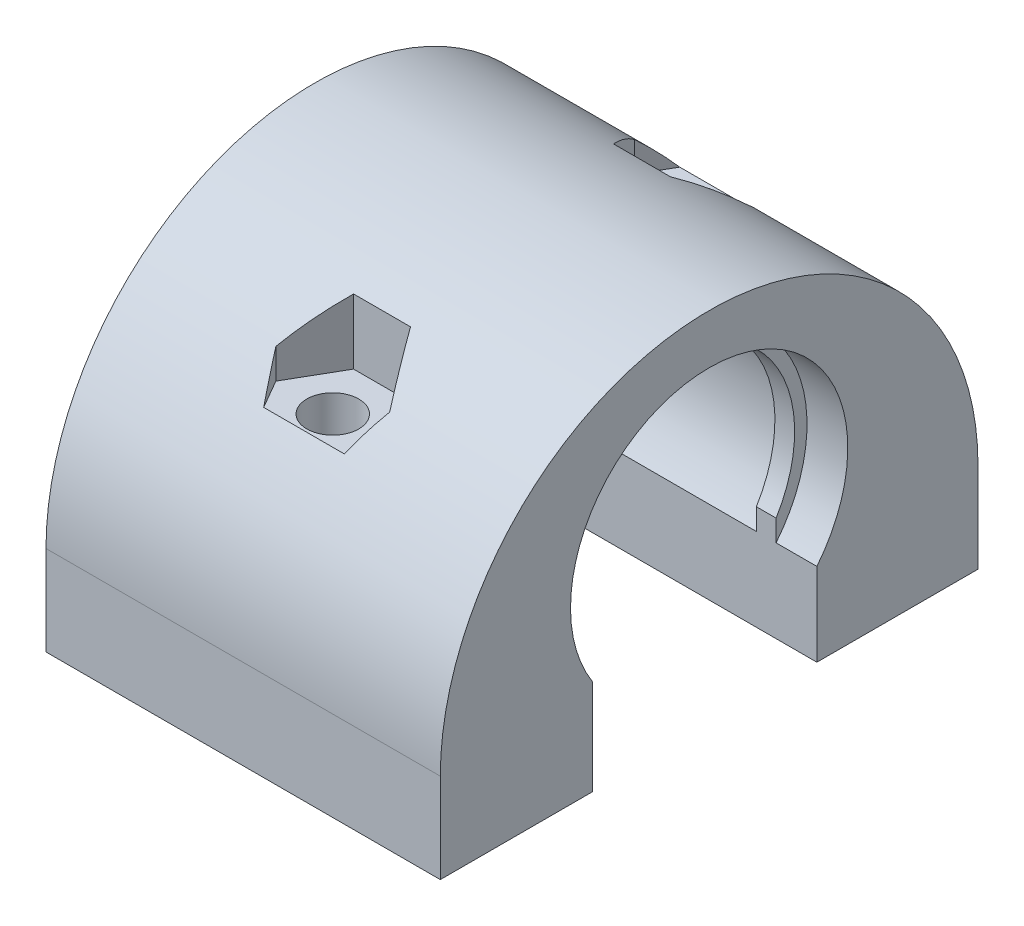
ISO-10303-21;
HEADER;
FILE_DESCRIPTION(('STEP AP214'),'2;1');
FILE_NAME('part.step','',(''),(''),'','','');
FILE_SCHEMA(('AUTOMOTIVE_DESIGN { 1 0 10303 214 1 1 1 1 }'));
ENDSEC;
DATA;
#1=APPLICATION_CONTEXT('core data for automotive mechanical design processes');
#2=APPLICATION_PROTOCOL_DEFINITION('international standard','automotive_design',2000,#1);
#3=PRODUCT_CONTEXT('',#1,'mechanical');
#4=PRODUCT('Part','Part','',(#3));
#5=PRODUCT_RELATED_PRODUCT_CATEGORY('part','',(#4));
#6=PRODUCT_DEFINITION_FORMATION('','',#4);
#7=PRODUCT_DEFINITION_CONTEXT('part definition',#1,'design');
#8=PRODUCT_DEFINITION('design','',#6,#7);
#9=PRODUCT_DEFINITION_SHAPE('','',#8);
#10=(LENGTH_UNIT() NAMED_UNIT(*) SI_UNIT(.MILLI.,.METRE.));
#11=(NAMED_UNIT(*) PLANE_ANGLE_UNIT() SI_UNIT($,.RADIAN.));
#12=(NAMED_UNIT(*) SI_UNIT($,.STERADIAN.) SOLID_ANGLE_UNIT());
#13=UNCERTAINTY_MEASURE_WITH_UNIT(LENGTH_MEASURE(1.E-05),#10,'distance_accuracy_value','');
#14=(GEOMETRIC_REPRESENTATION_CONTEXT(3) GLOBAL_UNCERTAINTY_ASSIGNED_CONTEXT((#13)) GLOBAL_UNIT_ASSIGNED_CONTEXT((#10,
#11,#12)) REPRESENTATION_CONTEXT('',''));
#15=CARTESIAN_POINT('',(0.,0.,0.));
#16=DIRECTION('',(0.,0.,1.));
#17=DIRECTION('',(1.,0.,0.));
#18=AXIS2_PLACEMENT_3D('',#15,#16,#17);
#19=CARTESIAN_POINT('',(3.00000000000002,9.5,0.));
#20=DIRECTION('',(-1.,0.,0.));
#21=DIRECTION('',(0.,0.,1.));
#22=AXIS2_PLACEMENT_3D('',#19,#20,#21);
#23=CYLINDRICAL_SURFACE('',#22,7.735);
#24=CARTESIAN_POINT('',(0.,9.5,0.));
#25=DIRECTION('',(-1.,0.,0.));
#26=DIRECTION('',(0.,0.,1.));
#27=AXIS2_PLACEMENT_3D('',#24,#25,#26);
#28=CIRCLE('',#27,7.735);
#29=CARTESIAN_POINT('',(0.,5.33016037673729,6.51480333673));
#30=VERTEX_POINT('',#29);
#31=CARTESIAN_POINT('',(0.,4.63069563489814,-6.01));
#32=VERTEX_POINT('',#31);
#33=EDGE_CURVE('E270',#30,#32,#28,.T.);
#34=ORIENTED_EDGE('',*,*,#33,.F.);
#35=DIRECTION('',(-1.,0.,0.));
#36=VECTOR('',#35,1.);
#37=CARTESIAN_POINT('',(3.00000000000002,5.33016037673729,6.51480333673));
#38=LINE('',#37,#36);
#39=CARTESIAN_POINT('',(-22.,5.33016037673729,6.51480333673));
#40=VERTEX_POINT('',#39);
#41=EDGE_CURVE('E51',#30,#40,#38,.T.);
#42=ORIENTED_EDGE('',*,*,#41,.T.);
#43=CARTESIAN_POINT('',(-22.,9.5,0.));
#44=DIRECTION('',(-1.,0.,0.));
#45=DIRECTION('',(0.,0.,1.));
#46=AXIS2_PLACEMENT_3D('',#43,#44,#45);
#47=CIRCLE('',#46,7.735);
#48=CARTESIAN_POINT('',(-22.,4.63069563489814,-6.01));
#49=VERTEX_POINT('',#48);
#50=EDGE_CURVE('E272',#40,#49,#47,.T.);
#51=ORIENTED_EDGE('',*,*,#50,.T.);
#52=DIRECTION('',(-1.,0.,0.));
#53=VECTOR('',#52,1.);
#54=CARTESIAN_POINT('',(3.00000000000002,4.63069563489814,-6.01));
#55=LINE('',#54,#53);
#56=CARTESIAN_POINT('',(-19.725,4.63069563489814,-6.01));
#57=VERTEX_POINT('',#56);
#58=EDGE_CURVE('E273',#49,#57,#55,.F.);
#59=ORIENTED_EDGE('',*,*,#58,.T.);
#60=CARTESIAN_POINT('',(-19.725,9.5,0.));
#61=DIRECTION('',(1.,0.,0.));
#62=DIRECTION('',(0.,0.,-1.));
#63=AXIS2_PLACEMENT_3D('',#60,#61,#62);
#64=CIRCLE('',#63,7.735);
#65=CARTESIAN_POINT('',(-19.725,17.2349983839688,-0.00500000000201291));
#66=VERTEX_POINT('',#65);
#67=EDGE_CURVE('E344',#66,#57,#64,.F.);
#68=ORIENTED_EDGE('',*,*,#67,.F.);
#69=DIRECTION('',(-1.,0.,0.));
#70=VECTOR('',#69,1.);
#71=CARTESIAN_POINT('',(-19.175,17.2349983839688,-0.00500000000201291));
#72=LINE('',#71,#70);
#73=CARTESIAN_POINT('',(-18.625,17.2349983839688,-0.00500000000201291));
#74=VERTEX_POINT('',#73);
#75=EDGE_CURVE('E336',#74,#66,#72,.T.);
#76=ORIENTED_EDGE('',*,*,#75,.F.);
#77=CARTESIAN_POINT('',(-18.625,9.5,0.));
#78=DIRECTION('',(-1.,0.,0.));
#79=DIRECTION('',(0.,0.,1.));
#80=AXIS2_PLACEMENT_3D('',#77,#78,#79);
#81=CIRCLE('',#80,7.735);
#82=CARTESIAN_POINT('',(-18.625,4.63069563489814,-6.01));
#83=VERTEX_POINT('',#82);
#84=EDGE_CURVE('E346',#83,#74,#81,.F.);
#85=ORIENTED_EDGE('',*,*,#84,.F.);
#86=CARTESIAN_POINT('',(-3.375,4.63069563489814,-6.01));
#87=VERTEX_POINT('',#86);
#88=EDGE_CURVE('E277',#83,#87,#55,.F.);
#89=ORIENTED_EDGE('',*,*,#88,.T.);
#90=CARTESIAN_POINT('',(-3.375,9.5,0.));
#91=DIRECTION('',(1.,0.,0.));
#92=DIRECTION('',(0.,0.,-1.));
#93=AXIS2_PLACEMENT_3D('',#90,#91,#92);
#94=CIRCLE('',#93,7.735);
#95=CARTESIAN_POINT('',(-3.375,17.2349983839688,-0.00500000000201291));
#96=VERTEX_POINT('',#95);
#97=EDGE_CURVE('E365',#96,#87,#94,.F.);
#98=ORIENTED_EDGE('',*,*,#97,.F.);
#99=DIRECTION('',(-1.,0.,0.));
#100=VECTOR('',#99,1.);
#101=CARTESIAN_POINT('',(-2.825,17.2349983839688,-0.00500000000201291));
#102=LINE('',#101,#100);
#103=CARTESIAN_POINT('',(-2.275,17.2349983839688,-0.00500000000201291));
#104=VERTEX_POINT('',#103);
#105=EDGE_CURVE('E359',#104,#96,#102,.T.);
#106=ORIENTED_EDGE('',*,*,#105,.F.);
#107=CARTESIAN_POINT('',(-2.275,9.5,0.));
#108=DIRECTION('',(-1.,0.,0.));
#109=DIRECTION('',(0.,0.,1.));
#110=AXIS2_PLACEMENT_3D('',#107,#108,#109);
#111=CIRCLE('',#110,7.735);
#112=CARTESIAN_POINT('',(-2.275,4.63069563489814,-6.01));
#113=VERTEX_POINT('',#112);
#114=EDGE_CURVE('E362',#113,#104,#111,.F.);
#115=ORIENTED_EDGE('',*,*,#114,.F.);
#116=EDGE_CURVE('E269',#113,#32,#55,.F.);
#117=ORIENTED_EDGE('',*,*,#116,.T.);
#118=EDGE_LOOP('',(#34,#42,#51,#59,#68,#76,#85,#89,#98,#106,#115,#117));
#119=FACE_BOUND('',#118,.T.);
#120=ADVANCED_FACE('F35',(#119),#23,.F.);
#121=CARTESIAN_POINT('',(-22.,4.99999999999999,-6.01));
#122=DIRECTION('',(0.,0.,-1.));
#123=DIRECTION('',(-1.,0.,0.));
#124=AXIS2_PLACEMENT_3D('',#121,#122,#123);
#125=PLANE('',#124);
#126=ORIENTED_EDGE('',*,*,#116,.F.);
#127=DIRECTION('',(0.,-1.,0.));
#128=VECTOR('',#127,1.);
#129=CARTESIAN_POINT('',(-2.275,17.235,-6.01));
#130=LINE('',#129,#128);
#131=CARTESIAN_POINT('',(-2.275,5.82695970618343,-6.01));
#132=VERTEX_POINT('',#131);
#133=EDGE_CURVE('E482',#132,#113,#130,.T.);
#134=ORIENTED_EDGE('',*,*,#133,.F.);
#135=DIRECTION('',(-1.,0.,0.));
#136=VECTOR('',#135,1.);
#137=CARTESIAN_POINT('',(-21.5348154568122,5.82695970618343,-6.01));
#138=LINE('',#137,#136);
#139=CARTESIAN_POINT('',(-3.375,5.82695970618343,-6.01));
#140=VERTEX_POINT('',#139);
#141=EDGE_CURVE('E485',#140,#132,#138,.F.);
#142=ORIENTED_EDGE('',*,*,#141,.F.);
#143=DIRECTION('',(0.,1.,0.));
#144=VECTOR('',#143,1.);
#145=CARTESIAN_POINT('',(-3.375,17.235,-6.01));
#146=LINE('',#145,#144);
#147=EDGE_CURVE('E472',#87,#140,#146,.T.);
#148=ORIENTED_EDGE('',*,*,#147,.F.);
#149=ORIENTED_EDGE('',*,*,#88,.F.);
#150=DIRECTION('',(0.,-1.,0.));
#151=VECTOR('',#150,1.);
#152=CARTESIAN_POINT('',(-18.625,17.235,-6.01));
#153=LINE('',#152,#151);
#154=CARTESIAN_POINT('',(-18.625,5.82695970618343,-6.01));
#155=VERTEX_POINT('',#154);
#156=EDGE_CURVE('E490',#155,#83,#153,.T.);
#157=ORIENTED_EDGE('',*,*,#156,.F.);
#158=DIRECTION('',(-1.,0.,0.));
#159=VECTOR('',#158,1.);
#160=CARTESIAN_POINT('',(-21.5348154568122,5.82695970618344,-6.01));
#161=LINE('',#160,#159);
#162=CARTESIAN_POINT('',(-19.725,5.82695970618344,-6.01));
#163=VERTEX_POINT('',#162);
#164=EDGE_CURVE('E11',#163,#155,#161,.F.);
#165=ORIENTED_EDGE('',*,*,#164,.F.);
#166=DIRECTION('',(0.,1.,0.));
#167=VECTOR('',#166,1.);
#168=CARTESIAN_POINT('',(-19.725,17.235,-6.01));
#169=LINE('',#168,#167);
#170=EDGE_CURVE('E333',#57,#163,#169,.T.);
#171=ORIENTED_EDGE('',*,*,#170,.F.);
#172=ORIENTED_EDGE('',*,*,#58,.F.);
#173=DIRECTION('',(0.,-1.,0.));
#174=VECTOR('',#173,1.);
#175=CARTESIAN_POINT('',(-22.,4.99999999999999,-6.01));
#176=LINE('',#175,#174);
#177=CARTESIAN_POINT('',(-22.,0.,-6.01));
#178=VERTEX_POINT('',#177);
#179=EDGE_CURVE('E420',#49,#178,#176,.T.);
#180=ORIENTED_EDGE('',*,*,#179,.T.);
#181=DIRECTION('',(1.,0.,0.));
#182=VECTOR('',#181,1.);
#183=CARTESIAN_POINT('',(-22.,0.,-6.01));
#184=LINE('',#183,#182);
#185=CARTESIAN_POINT('',(0.,0.,-6.01));
#186=VERTEX_POINT('',#185);
#187=EDGE_CURVE('E418',#178,#186,#184,.T.);
#188=ORIENTED_EDGE('',*,*,#187,.T.);
#189=DIRECTION('',(0.,-1.,0.));
#190=VECTOR('',#189,1.);
#191=CARTESIAN_POINT('',(0.,4.99999999999999,-6.01));
#192=LINE('',#191,#190);
#193=EDGE_CURVE('E421',#32,#186,#192,.T.);
#194=ORIENTED_EDGE('',*,*,#193,.F.);
#195=EDGE_LOOP('',(#126,#134,#142,#148,#149,#157,#165,#171,#172,#180,#188,#194));
#196=FACE_BOUND('',#195,.T.);
#197=ADVANCED_FACE('F457',(#196),#125,.F.);
#198=CARTESIAN_POINT('',(-22.,5.,0.));
#199=DIRECTION('',(-1.,0.,0.));
#200=DIRECTION('',(0.,0.,1.));
#201=AXIS2_PLACEMENT_3D('',#198,#199,#200);
#202=CYLINDRICAL_SURFACE('',#201,15.);
#203=CARTESIAN_POINT('',(-2.05149730810374,5.,0.));
#204=DIRECTION('',(-0.866025403784439,0.,0.5));
#205=DIRECTION('',(-0.5,0.,-0.866025403784439));
#206=AXIS2_PLACEMENT_3D('',#203,#204,#205);
#207=ELLIPSE('',#206,17.3205080756888,15.);
#208=CARTESIAN_POINT('',(-8.75348706239811,14.5,-11.6081867662439));
#209=VERTEX_POINT('',#208);
#210=CARTESIAN_POINT('',(-7.825,16.1803398874989,-10.));
#211=VERTEX_POINT('',#210);
#212=EDGE_CURVE('E276',#209,#211,#207,.F.);
#213=ORIENTED_EDGE('',*,*,#212,.T.);
#214=CARTESIAN_POINT('',(-13.5985026918963,5.,0.));
#215=DIRECTION('',(-0.866025403784439,0.,-0.5));
#216=DIRECTION('',(-0.5,0.,0.866025403784439));
#217=AXIS2_PLACEMENT_3D('',#214,#215,#216);
#218=ELLIPSE('',#217,17.3205080756888,15.);
#219=CARTESIAN_POINT('',(-9.4125,18.1313420635635,-7.25036934298441));
#220=VERTEX_POINT('',#219);
#221=EDGE_CURVE('E298',#211,#220,#218,.F.);
#222=ORIENTED_EDGE('',*,*,#221,.T.);
#223=DIRECTION('',(-1.,0.,0.));
#224=VECTOR('',#223,1.);
#225=CARTESIAN_POINT('',(-22.,18.1313420635635,-7.25036934298441));
#226=LINE('',#225,#224);
#227=CARTESIAN_POINT('',(-12.5875,18.1313420635635,-7.25036934298441));
#228=VERTEX_POINT('',#227);
#229=EDGE_CURVE('E295',#220,#228,#226,.T.);
#230=ORIENTED_EDGE('',*,*,#229,.T.);
#231=CARTESIAN_POINT('',(-8.40149730810373,5.,0.));
#232=DIRECTION('',(0.866025403784438,0.,-0.5));
#233=DIRECTION('',(-0.5,0.,-0.866025403784438));
#234=AXIS2_PLACEMENT_3D('',#231,#232,#233);
#235=ELLIPSE('',#234,17.3205080756888,15.);
#236=CARTESIAN_POINT('',(-14.175,16.1803398874989,-10.));
#237=VERTEX_POINT('',#236);
#238=EDGE_CURVE('E292',#228,#237,#235,.F.);
#239=ORIENTED_EDGE('',*,*,#238,.T.);
#240=CARTESIAN_POINT('',(-19.9485026918963,5.,0.));
#241=DIRECTION('',(0.866025403784438,0.,0.500000000000001));
#242=DIRECTION('',(-0.500000000000001,0.,0.866025403784438));
#243=AXIS2_PLACEMENT_3D('',#240,#241,#242);
#244=ELLIPSE('',#243,17.3205080756888,15.);
#245=CARTESIAN_POINT('',(-13.2465129376019,14.5,-11.6081867662439));
#246=VERTEX_POINT('',#245);
#247=EDGE_CURVE('E289',#237,#246,#244,.F.);
#248=ORIENTED_EDGE('',*,*,#247,.T.);
#249=DIRECTION('',(-1.,0.,0.));
#250=VECTOR('',#249,1.);
#251=CARTESIAN_POINT('',(-22.,14.5,-11.6081867662439));
#252=LINE('',#251,#250);
#253=EDGE_CURVE('E281',#246,#209,#252,.F.);
#254=ORIENTED_EDGE('',*,*,#253,.T.);
#255=EDGE_LOOP('',(#213,#222,#230,#239,#248,#254));
#256=FACE_BOUND('',#255,.T.);
#257=DIRECTION('',(1.,0.,0.));
#258=VECTOR('',#257,1.);
#259=CARTESIAN_POINT('',(-22.,5.,-15.));
#260=LINE('',#259,#258);
#261=CARTESIAN_POINT('',(-22.,5.,-15.));
#262=VERTEX_POINT('',#261);
#263=CARTESIAN_POINT('',(0.,5.,-15.));
#264=VERTEX_POINT('',#263);
#265=EDGE_CURVE('E259',#262,#264,#260,.T.);
#266=ORIENTED_EDGE('',*,*,#265,.F.);
#267=CARTESIAN_POINT('',(-22.,5.,0.));
#268=DIRECTION('',(1.,0.,0.));
#269=DIRECTION('',(0.,0.,-1.));
#270=AXIS2_PLACEMENT_3D('',#267,#268,#269);
#271=CIRCLE('',#270,15.);
#272=CARTESIAN_POINT('',(-22.,5.,15.));
#273=VERTEX_POINT('',#272);
#274=EDGE_CURVE('E265',#273,#262,#271,.F.);
#275=ORIENTED_EDGE('',*,*,#274,.F.);
#276=DIRECTION('',(1.,0.,0.));
#277=VECTOR('',#276,1.);
#278=CARTESIAN_POINT('',(-22.,5.,15.));
#279=LINE('',#278,#277);
#280=CARTESIAN_POINT('',(0.,5.,15.));
#281=VERTEX_POINT('',#280);
#282=EDGE_CURVE('E262',#281,#273,#279,.F.);
#283=ORIENTED_EDGE('',*,*,#282,.F.);
#284=CARTESIAN_POINT('',(0.,5.,0.));
#285=DIRECTION('',(-1.,0.,0.));
#286=DIRECTION('',(0.,0.,1.));
#287=AXIS2_PLACEMENT_3D('',#284,#285,#286);
#288=CIRCLE('',#287,15.);
#289=EDGE_CURVE('E267',#264,#281,#288,.F.);
#290=ORIENTED_EDGE('',*,*,#289,.F.);
#291=EDGE_LOOP('',(#266,#275,#283,#290));
#292=FACE_BOUND('',#291,.T.);
#293=DIRECTION('',(-1.,0.,0.));
#294=VECTOR('',#293,1.);
#295=CARTESIAN_POINT('',(-22.,14.5,11.6081867662439));
#296=LINE('',#295,#294);
#297=CARTESIAN_POINT('',(-8.75348706239811,14.5,11.6081867662439));
#298=VERTEX_POINT('',#297);
#299=CARTESIAN_POINT('',(-13.2465129376019,14.5,11.6081867662439));
#300=VERTEX_POINT('',#299);
#301=EDGE_CURVE('E286',#298,#300,#296,.T.);
#302=ORIENTED_EDGE('',*,*,#301,.T.);
#303=CARTESIAN_POINT('',(-19.9485026918963,5.,0.));
#304=DIRECTION('',(0.866025403784439,0.,-0.5));
#305=DIRECTION('',(-0.5,0.,-0.866025403784439));
#306=AXIS2_PLACEMENT_3D('',#303,#304,#305);
#307=ELLIPSE('',#306,17.3205080756888,15.);
#308=CARTESIAN_POINT('',(-14.175,16.180339887499,10.));
#309=VERTEX_POINT('',#308);
#310=EDGE_CURVE('E313',#300,#309,#307,.F.);
#311=ORIENTED_EDGE('',*,*,#310,.T.);
#312=CARTESIAN_POINT('',(-8.40149730810373,5.,0.));
#313=DIRECTION('',(0.866025403784439,0.,0.5));
#314=DIRECTION('',(-0.5,0.,0.866025403784439));
#315=AXIS2_PLACEMENT_3D('',#312,#313,#314);
#316=ELLIPSE('',#315,17.3205080756888,15.);
#317=CARTESIAN_POINT('',(-12.5875,18.1313420635635,7.25036934298441));
#318=VERTEX_POINT('',#317);
#319=EDGE_CURVE('E310',#309,#318,#316,.F.);
#320=ORIENTED_EDGE('',*,*,#319,.T.);
#321=DIRECTION('',(-1.,0.,0.));
#322=VECTOR('',#321,1.);
#323=CARTESIAN_POINT('',(-22.,18.1313420635635,7.25036934298441));
#324=LINE('',#323,#322);
#325=CARTESIAN_POINT('',(-9.41249999999999,18.1313420635635,7.25036934298441));
#326=VERTEX_POINT('',#325);
#327=EDGE_CURVE('E307',#318,#326,#324,.F.);
#328=ORIENTED_EDGE('',*,*,#327,.T.);
#329=CARTESIAN_POINT('',(-13.5985026918962,5.,0.));
#330=DIRECTION('',(-0.866025403784439,0.,0.499999999999999));
#331=DIRECTION('',(-0.499999999999999,0.,-0.866025403784439));
#332=AXIS2_PLACEMENT_3D('',#329,#330,#331);
#333=ELLIPSE('',#332,17.3205080756888,15.);
#334=CARTESIAN_POINT('',(-7.82499999999999,16.180339887499,10.));
#335=VERTEX_POINT('',#334);
#336=EDGE_CURVE('E304',#326,#335,#333,.F.);
#337=ORIENTED_EDGE('',*,*,#336,.T.);
#338=CARTESIAN_POINT('',(-2.05149730810374,5.,0.));
#339=DIRECTION('',(-0.866025403784439,0.,-0.5));
#340=DIRECTION('',(-0.5,0.,0.866025403784439));
#341=AXIS2_PLACEMENT_3D('',#338,#339,#340);
#342=ELLIPSE('',#341,17.3205080756888,15.);
#343=EDGE_CURVE('E301',#335,#298,#342,.F.);
#344=ORIENTED_EDGE('',*,*,#343,.T.);
#345=EDGE_LOOP('',(#302,#311,#320,#328,#337,#344));
#346=FACE_BOUND('',#345,.T.);
#347=ADVANCED_FACE('F38',(#256,#292,#346),#202,.T.);
#348=CARTESIAN_POINT('',(-11.,19.,10.));
#349=DIRECTION('',(0.,-1.,0.));
#350=DIRECTION('',(0.,0.,-1.));
#351=AXIS2_PLACEMENT_3D('',#348,#349,#350);
#352=CYLINDRICAL_SURFACE('',#351,1.45);
#353=CARTESIAN_POINT('',(-11.,0.,10.));
#354=DIRECTION('',(0.,-1.,0.));
#355=DIRECTION('',(0.,0.,-1.));
#356=AXIS2_PLACEMENT_3D('',#353,#354,#355);
#357=CIRCLE('',#356,1.45);
#358=CARTESIAN_POINT('',(-11.,0.,8.55));
#359=VERTEX_POINT('',#358);
#360=EDGE_CURVE('E424',#359,#359,#357,.T.);
#361=ORIENTED_EDGE('',*,*,#360,.T.);
#362=EDGE_LOOP('',(#361));
#363=FACE_BOUND('',#362,.T.);
#364=CARTESIAN_POINT('',(-11.,14.5,10.));
#365=DIRECTION('',(0.,1.,0.));
#366=DIRECTION('',(0.,0.,1.));
#367=AXIS2_PLACEMENT_3D('',#364,#365,#366);
#368=CIRCLE('',#367,1.45);
#369=CARTESIAN_POINT('',(-11.,14.5,11.45));
#370=VERTEX_POINT('',#369);
#371=EDGE_CURVE('E283',#370,#370,#368,.F.);
#372=ORIENTED_EDGE('',*,*,#371,.F.);
#373=EDGE_LOOP('',(#372));
#374=FACE_BOUND('',#373,.T.);
#375=ADVANCED_FACE('F529',(#363,#374),#352,.F.);
#376=CARTESIAN_POINT('',(-11.,19.,-10.));
#377=DIRECTION('',(0.,-1.,0.));
#378=DIRECTION('',(0.,0.,-1.));
#379=AXIS2_PLACEMENT_3D('',#376,#377,#378);
#380=CYLINDRICAL_SURFACE('',#379,1.45);
#381=CARTESIAN_POINT('',(-11.,0.,-10.));
#382=DIRECTION('',(0.,-1.,0.));
#383=DIRECTION('',(0.,0.,-1.));
#384=AXIS2_PLACEMENT_3D('',#381,#382,#383);
#385=CIRCLE('',#384,1.45);
#386=CARTESIAN_POINT('',(-11.,0.,-11.45));
#387=VERTEX_POINT('',#386);
#388=EDGE_CURVE('E426',#387,#387,#385,.T.);
#389=ORIENTED_EDGE('',*,*,#388,.T.);
#390=EDGE_LOOP('',(#389));
#391=FACE_BOUND('',#390,.T.);
#392=CARTESIAN_POINT('',(-11.,14.5,-10.));
#393=DIRECTION('',(0.,1.,0.));
#394=DIRECTION('',(0.,0.,1.));
#395=AXIS2_PLACEMENT_3D('',#392,#393,#394);
#396=CIRCLE('',#395,1.45);
#397=CARTESIAN_POINT('',(-11.,14.5,-8.55));
#398=VERTEX_POINT('',#397);
#399=EDGE_CURVE('E278',#398,#398,#396,.F.);
#400=ORIENTED_EDGE('',*,*,#399,.F.);
#401=EDGE_LOOP('',(#400));
#402=FACE_BOUND('',#401,.T.);
#403=ADVANCED_FACE('F544',(#391,#402),#380,.F.);
#404=CARTESIAN_POINT('',(0.,0.,0.));
#405=DIRECTION('',(0.,1.,0.));
#406=DIRECTION('',(0.,0.,1.));
#407=AXIS2_PLACEMENT_3D('',#404,#405,#406);
#408=PLANE('',#407);
#409=ORIENTED_EDGE('',*,*,#360,.F.);
#410=EDGE_LOOP('',(#409));
#411=FACE_BOUND('',#410,.T.);
#412=DIRECTION('',(0.,0.,1.));
#413=VECTOR('',#412,1.);
#414=CARTESIAN_POINT('',(-22.,0.,-15.));
#415=LINE('',#414,#413);
#416=CARTESIAN_POINT('',(-22.,0.,6.51480333673));
#417=VERTEX_POINT('',#416);
#418=CARTESIAN_POINT('',(-22.,0.,15.));
#419=VERTEX_POINT('',#418);
#420=EDGE_CURVE('E234',#417,#419,#415,.T.);
#421=ORIENTED_EDGE('',*,*,#420,.F.);
#422=DIRECTION('',(-1.,0.,0.));
#423=VECTOR('',#422,1.);
#424=CARTESIAN_POINT('',(0.,0.,6.51480333673));
#425=LINE('',#424,#423);
#426=CARTESIAN_POINT('',(0.,0.,6.51480333673));
#427=VERTEX_POINT('',#426);
#428=EDGE_CURVE('E221',#427,#417,#425,.T.);
#429=ORIENTED_EDGE('',*,*,#428,.F.);
#430=DIRECTION('',(0.,0.,-1.));
#431=VECTOR('',#430,1.);
#432=CARTESIAN_POINT('',(0.,0.,-15.));
#433=LINE('',#432,#431);
#434=CARTESIAN_POINT('',(0.,0.,15.));
#435=VERTEX_POINT('',#434);
#436=EDGE_CURVE('E233',#435,#427,#433,.T.);
#437=ORIENTED_EDGE('',*,*,#436,.F.);
#438=DIRECTION('',(1.,0.,0.));
#439=VECTOR('',#438,1.);
#440=CARTESIAN_POINT('',(-22.,0.,15.));
#441=LINE('',#440,#439);
#442=EDGE_CURVE('E247',#419,#435,#441,.T.);
#443=ORIENTED_EDGE('',*,*,#442,.F.);
#444=EDGE_LOOP('',(#421,#429,#437,#443));
#445=FACE_BOUND('',#444,.T.);
#446=ADVANCED_FACE('F231',(#411,#445),#408,.F.);
#447=CARTESIAN_POINT('',(-22.,20.,-15.));
#448=DIRECTION('',(1.,0.,0.));
#449=DIRECTION('',(0.,0.,-1.));
#450=AXIS2_PLACEMENT_3D('',#447,#448,#449);
#451=PLANE('',#450);
#452=ORIENTED_EDGE('',*,*,#50,.F.);
#453=DIRECTION('',(0.,1.,0.));
#454=VECTOR('',#453,1.);
#455=CARTESIAN_POINT('',(-22.,0.,6.51480333673));
#456=LINE('',#455,#454);
#457=EDGE_CURVE('E226',#417,#40,#456,.T.);
#458=ORIENTED_EDGE('',*,*,#457,.F.);
#459=ORIENTED_EDGE('',*,*,#420,.T.);
#460=DIRECTION('',(0.,-1.,0.));
#461=VECTOR('',#460,1.);
#462=CARTESIAN_POINT('',(-22.,20.,15.));
#463=LINE('',#462,#461);
#464=EDGE_CURVE('E256',#273,#419,#463,.T.);
#465=ORIENTED_EDGE('',*,*,#464,.F.);
#466=ORIENTED_EDGE('',*,*,#274,.T.);
#467=DIRECTION('',(0.,-1.,0.));
#468=VECTOR('',#467,1.);
#469=CARTESIAN_POINT('',(-22.,20.,-15.));
#470=LINE('',#469,#468);
#471=CARTESIAN_POINT('',(-22.,0.,-15.));
#472=VERTEX_POINT('',#471);
#473=EDGE_CURVE('E245',#262,#472,#470,.T.);
#474=ORIENTED_EDGE('',*,*,#473,.T.);
#475=EDGE_CURVE('E431',#472,#178,#415,.T.);
#476=ORIENTED_EDGE('',*,*,#475,.T.);
#477=ORIENTED_EDGE('',*,*,#179,.F.);
#478=EDGE_LOOP('',(#452,#458,#459,#465,#466,#474,#476,#477));
#479=FACE_BOUND('',#478,.T.);
#480=ADVANCED_FACE('F438',(#479),#451,.F.);
#481=CARTESIAN_POINT('',(-22.,20.,15.));
#482=DIRECTION('',(0.,0.,-1.));
#483=DIRECTION('',(-1.,0.,0.));
#484=AXIS2_PLACEMENT_3D('',#481,#482,#483);
#485=PLANE('',#484);
#486=ORIENTED_EDGE('',*,*,#464,.T.);
#487=ORIENTED_EDGE('',*,*,#442,.T.);
#488=DIRECTION('',(0.,-1.,0.));
#489=VECTOR('',#488,1.);
#490=CARTESIAN_POINT('',(0.,20.,15.));
#491=LINE('',#490,#489);
#492=EDGE_CURVE('E239',#281,#435,#491,.T.);
#493=ORIENTED_EDGE('',*,*,#492,.F.);
#494=ORIENTED_EDGE('',*,*,#282,.T.);
#495=EDGE_LOOP('',(#486,#487,#493,#494));
#496=FACE_BOUND('',#495,.T.);
#497=ADVANCED_FACE('F440',(#496),#485,.F.);
#498=CARTESIAN_POINT('',(0.,20.,-15.));
#499=DIRECTION('',(-1.,0.,0.));
#500=DIRECTION('',(0.,0.,1.));
#501=AXIS2_PLACEMENT_3D('',#498,#499,#500);
#502=PLANE('',#501);
#503=ORIENTED_EDGE('',*,*,#436,.T.);
#504=DIRECTION('',(0.,1.,0.));
#505=VECTOR('',#504,1.);
#506=CARTESIAN_POINT('',(0.,0.,6.51480333673));
#507=LINE('',#506,#505);
#508=EDGE_CURVE('E218',#427,#30,#507,.T.);
#509=ORIENTED_EDGE('',*,*,#508,.T.);
#510=ORIENTED_EDGE('',*,*,#33,.T.);
#511=ORIENTED_EDGE('',*,*,#193,.T.);
#512=CARTESIAN_POINT('',(0.,0.,-15.));
#513=VERTEX_POINT('',#512);
#514=EDGE_CURVE('E242',#186,#513,#433,.T.);
#515=ORIENTED_EDGE('',*,*,#514,.T.);
#516=DIRECTION('',(0.,-1.,0.));
#517=VECTOR('',#516,1.);
#518=CARTESIAN_POINT('',(0.,20.,-15.));
#519=LINE('',#518,#517);
#520=EDGE_CURVE('E252',#264,#513,#519,.T.);
#521=ORIENTED_EDGE('',*,*,#520,.F.);
#522=ORIENTED_EDGE('',*,*,#289,.T.);
#523=ORIENTED_EDGE('',*,*,#492,.T.);
#524=EDGE_LOOP('',(#503,#509,#510,#511,#515,#521,#522,#523));
#525=FACE_BOUND('',#524,.T.);
#526=ADVANCED_FACE('F237',(#525),#502,.F.);
#527=CARTESIAN_POINT('',(-22.,20.,-15.));
#528=DIRECTION('',(0.,0.,1.));
#529=DIRECTION('',(1.,0.,0.));
#530=AXIS2_PLACEMENT_3D('',#527,#528,#529);
#531=PLANE('',#530);
#532=ORIENTED_EDGE('',*,*,#473,.F.);
#533=ORIENTED_EDGE('',*,*,#265,.T.);
#534=ORIENTED_EDGE('',*,*,#520,.T.);
#535=DIRECTION('',(-1.,0.,0.));
#536=VECTOR('',#535,1.);
#537=CARTESIAN_POINT('',(-22.,0.,-15.));
#538=LINE('',#537,#536);
#539=EDGE_CURVE('E241',#513,#472,#538,.T.);
#540=ORIENTED_EDGE('',*,*,#539,.T.);
#541=EDGE_LOOP('',(#532,#533,#534,#540));
#542=FACE_BOUND('',#541,.T.);
#543=ADVANCED_FACE('F448',(#542),#531,.F.);
#544=ORIENTED_EDGE('',*,*,#388,.F.);
#545=EDGE_LOOP('',(#544));
#546=FACE_BOUND('',#545,.T.);
#547=ORIENTED_EDGE('',*,*,#514,.F.);
#548=ORIENTED_EDGE('',*,*,#187,.F.);
#549=ORIENTED_EDGE('',*,*,#475,.F.);
#550=ORIENTED_EDGE('',*,*,#539,.F.);
#551=EDGE_LOOP('',(#547,#548,#549,#550));
#552=FACE_BOUND('',#551,.T.);
#553=ADVANCED_FACE('F453',(#546,#552),#408,.F.);
#554=CARTESIAN_POINT('',(0.,14.5,0.));
#555=DIRECTION('',(0.,1.,0.));
#556=DIRECTION('',(0.,0.,1.));
#557=AXIS2_PLACEMENT_3D('',#554,#555,#556);
#558=PLANE('',#557);
#559=DIRECTION('',(0.500000000000001,0.,-0.866025403784438));
#560=VECTOR('',#559,1.);
#561=CARTESIAN_POINT('',(-12.5875,14.5,-12.7496306570156));
#562=LINE('',#561,#560);
#563=CARTESIAN_POINT('',(-14.175,14.5,-10.));
#564=VERTEX_POINT('',#563);
#565=EDGE_CURVE('E398',#564,#246,#562,.T.);
#566=ORIENTED_EDGE('',*,*,#565,.F.);
#567=DIRECTION('',(-0.5,0.,-0.866025403784438));
#568=VECTOR('',#567,1.);
#569=CARTESIAN_POINT('',(-14.175,14.5,-10.));
#570=LINE('',#569,#568);
#571=CARTESIAN_POINT('',(-12.5875,14.5,-7.25036934298441));
#572=VERTEX_POINT('',#571);
#573=EDGE_CURVE('E396',#572,#564,#570,.T.);
#574=ORIENTED_EDGE('',*,*,#573,.F.);
#575=DIRECTION('',(-1.,0.,0.));
#576=VECTOR('',#575,1.);
#577=CARTESIAN_POINT('',(-12.5875,14.5,-7.25036934298441));
#578=LINE('',#577,#576);
#579=CARTESIAN_POINT('',(-9.4125,14.5,-7.25036934298441));
#580=VERTEX_POINT('',#579);
#581=EDGE_CURVE('E394',#580,#572,#578,.T.);
#582=ORIENTED_EDGE('',*,*,#581,.F.);
#583=DIRECTION('',(-0.5,0.,0.866025403784439));
#584=VECTOR('',#583,1.);
#585=CARTESIAN_POINT('',(-9.4125,14.5,-7.25036934298441));
#586=LINE('',#585,#584);
#587=CARTESIAN_POINT('',(-7.825,14.5,-10.));
#588=VERTEX_POINT('',#587);
#589=EDGE_CURVE('E368',#588,#580,#586,.T.);
#590=ORIENTED_EDGE('',*,*,#589,.F.);
#591=DIRECTION('',(0.5,0.,0.866025403784439));
#592=VECTOR('',#591,1.);
#593=CARTESIAN_POINT('',(-7.825,14.5,-10.));
#594=LINE('',#593,#592);
#595=EDGE_CURVE('E401',#209,#588,#594,.T.);
#596=ORIENTED_EDGE('',*,*,#595,.F.);
#597=ORIENTED_EDGE('',*,*,#253,.F.);
#598=EDGE_LOOP('',(#566,#574,#582,#590,#596,#597));
#599=FACE_BOUND('',#598,.T.);
#600=ORIENTED_EDGE('',*,*,#399,.T.);
#601=EDGE_LOOP('',(#600));
#602=FACE_BOUND('',#601,.T.);
#603=ADVANCED_FACE('F533',(#599,#602),#558,.T.);
#604=CARTESIAN_POINT('',(-9.4125,14.5,-7.25036934298441));
#605=DIRECTION('',(-0.866025403784439,0.,-0.5));
#606=DIRECTION('',(-0.5,0.,0.866025403784439));
#607=AXIS2_PLACEMENT_3D('',#604,#605,#606);
#608=PLANE('',#607);
#609=DIRECTION('',(0.,1.,0.));
#610=VECTOR('',#609,1.);
#611=CARTESIAN_POINT('',(-7.825,14.5,-10.));
#612=LINE('',#611,#610);
#613=EDGE_CURVE('E403',#588,#211,#612,.T.);
#614=ORIENTED_EDGE('',*,*,#613,.F.);
#615=ORIENTED_EDGE('',*,*,#589,.T.);
#616=DIRECTION('',(0.,1.,0.));
#617=VECTOR('',#616,1.);
#618=CARTESIAN_POINT('',(-9.4125,14.5,-7.25036934298441));
#619=LINE('',#618,#617);
#620=EDGE_CURVE('E372',#580,#220,#619,.T.);
#621=ORIENTED_EDGE('',*,*,#620,.T.);
#622=ORIENTED_EDGE('',*,*,#221,.F.);
#623=EDGE_LOOP('',(#614,#615,#621,#622));
#624=FACE_BOUND('',#623,.T.);
#625=ADVANCED_FACE('F592',(#624),#608,.T.);
#626=CARTESIAN_POINT('',(-12.5875,14.5,-7.25036934298441));
#627=DIRECTION('',(0.,0.,-1.));
#628=DIRECTION('',(-1.,0.,0.));
#629=AXIS2_PLACEMENT_3D('',#626,#627,#628);
#630=PLANE('',#629);
#631=ORIENTED_EDGE('',*,*,#620,.F.);
#632=ORIENTED_EDGE('',*,*,#581,.T.);
#633=DIRECTION('',(0.,1.,0.));
#634=VECTOR('',#633,1.);
#635=CARTESIAN_POINT('',(-12.5875,14.5,-7.25036934298441));
#636=LINE('',#635,#634);
#637=EDGE_CURVE('E409',#572,#228,#636,.T.);
#638=ORIENTED_EDGE('',*,*,#637,.T.);
#639=ORIENTED_EDGE('',*,*,#229,.F.);
#640=EDGE_LOOP('',(#631,#632,#638,#639));
#641=FACE_BOUND('',#640,.T.);
#642=ADVANCED_FACE('F601',(#641),#630,.T.);
#643=CARTESIAN_POINT('',(-14.175,14.5,-10.));
#644=DIRECTION('',(0.866025403784438,0.,-0.5));
#645=DIRECTION('',(-0.5,0.,-0.866025403784438));
#646=AXIS2_PLACEMENT_3D('',#643,#644,#645);
#647=PLANE('',#646);
#648=ORIENTED_EDGE('',*,*,#637,.F.);
#649=ORIENTED_EDGE('',*,*,#573,.T.);
#650=DIRECTION('',(0.,1.,0.));
#651=VECTOR('',#650,1.);
#652=CARTESIAN_POINT('',(-14.175,14.5,-10.));
#653=LINE('',#652,#651);
#654=EDGE_CURVE('E406',#564,#237,#653,.T.);
#655=ORIENTED_EDGE('',*,*,#654,.T.);
#656=ORIENTED_EDGE('',*,*,#238,.F.);
#657=EDGE_LOOP('',(#648,#649,#655,#656));
#658=FACE_BOUND('',#657,.T.);
#659=ADVANCED_FACE('F597',(#658),#647,.T.);
#660=CARTESIAN_POINT('',(-12.5875,14.5,-12.7496306570156));
#661=DIRECTION('',(0.866025403784438,0.,0.500000000000001));
#662=DIRECTION('',(0.500000000000001,0.,-0.866025403784438));
#663=AXIS2_PLACEMENT_3D('',#660,#661,#662);
#664=PLANE('',#663);
#665=ORIENTED_EDGE('',*,*,#654,.F.);
#666=ORIENTED_EDGE('',*,*,#565,.T.);
#667=ORIENTED_EDGE('',*,*,#247,.F.);
#668=EDGE_LOOP('',(#665,#666,#667));
#669=FACE_BOUND('',#668,.T.);
#670=ADVANCED_FACE('F569',(#669),#664,.T.);
#671=CARTESIAN_POINT('',(-7.825,14.5,-10.));
#672=DIRECTION('',(-0.866025403784439,0.,0.5));
#673=DIRECTION('',(0.5,0.,0.866025403784439));
#674=AXIS2_PLACEMENT_3D('',#671,#672,#673);
#675=PLANE('',#674);
#676=ORIENTED_EDGE('',*,*,#595,.T.);
#677=ORIENTED_EDGE('',*,*,#613,.T.);
#678=ORIENTED_EDGE('',*,*,#212,.F.);
#679=EDGE_LOOP('',(#676,#677,#678));
#680=FACE_BOUND('',#679,.T.);
#681=ADVANCED_FACE('F559',(#680),#675,.T.);
#682=CARTESIAN_POINT('',(0.,14.5,0.));
#683=DIRECTION('',(0.,1.,0.));
#684=DIRECTION('',(0.,0.,1.));
#685=AXIS2_PLACEMENT_3D('',#682,#683,#684);
#686=PLANE('',#685);
#687=DIRECTION('',(-0.5,0.,0.866025403784439));
#688=VECTOR('',#687,1.);
#689=CARTESIAN_POINT('',(-9.4125,14.5,12.7496306570156));
#690=LINE('',#689,#688);
#691=CARTESIAN_POINT('',(-7.82499999999999,14.5,10.));
#692=VERTEX_POINT('',#691);
#693=EDGE_CURVE('E378',#692,#298,#690,.T.);
#694=ORIENTED_EDGE('',*,*,#693,.F.);
#695=DIRECTION('',(0.499999999999999,0.,0.866025403784439));
#696=VECTOR('',#695,1.);
#697=CARTESIAN_POINT('',(-7.82499999999999,14.5,10.));
#698=LINE('',#697,#696);
#699=CARTESIAN_POINT('',(-9.41249999999999,14.5,7.25036934298441));
#700=VERTEX_POINT('',#699);
#701=EDGE_CURVE('E376',#700,#692,#698,.T.);
#702=ORIENTED_EDGE('',*,*,#701,.F.);
#703=DIRECTION('',(1.,0.,0.));
#704=VECTOR('',#703,1.);
#705=CARTESIAN_POINT('',(-9.41249999999999,14.5,7.25036934298441));
#706=LINE('',#705,#704);
#707=CARTESIAN_POINT('',(-12.5875,14.5,7.25036934298441));
#708=VERTEX_POINT('',#707);
#709=EDGE_CURVE('E374',#708,#700,#706,.T.);
#710=ORIENTED_EDGE('',*,*,#709,.F.);
#711=DIRECTION('',(0.5,0.,-0.866025403784439));
#712=VECTOR('',#711,1.);
#713=CARTESIAN_POINT('',(-12.5875,14.5,7.25036934298441));
#714=LINE('',#713,#712);
#715=CARTESIAN_POINT('',(-14.175,14.5,10.));
#716=VERTEX_POINT('',#715);
#717=EDGE_CURVE('E371',#716,#708,#714,.T.);
#718=ORIENTED_EDGE('',*,*,#717,.F.);
#719=DIRECTION('',(-0.5,0.,-0.866025403784439));
#720=VECTOR('',#719,1.);
#721=CARTESIAN_POINT('',(-14.175,14.5,10.));
#722=LINE('',#721,#720);
#723=EDGE_CURVE('E369',#300,#716,#722,.T.);
#724=ORIENTED_EDGE('',*,*,#723,.F.);
#725=ORIENTED_EDGE('',*,*,#301,.F.);
#726=EDGE_LOOP('',(#694,#702,#710,#718,#724,#725));
#727=FACE_BOUND('',#726,.T.);
#728=ORIENTED_EDGE('',*,*,#371,.T.);
#729=EDGE_LOOP('',(#728));
#730=FACE_BOUND('',#729,.T.);
#731=ADVANCED_FACE('F556',(#727,#730),#686,.T.);
#732=CARTESIAN_POINT('',(-14.175,14.5,10.));
#733=DIRECTION('',(0.866025403784439,0.,-0.5));
#734=DIRECTION('',(-0.5,0.,-0.866025403784439));
#735=AXIS2_PLACEMENT_3D('',#732,#733,#734);
#736=PLANE('',#735);
#737=ORIENTED_EDGE('',*,*,#723,.T.);
#738=DIRECTION('',(0.,1.,0.));
#739=VECTOR('',#738,1.);
#740=CARTESIAN_POINT('',(-14.175,14.5,10.));
#741=LINE('',#740,#739);
#742=EDGE_CURVE('E282',#716,#309,#741,.T.);
#743=ORIENTED_EDGE('',*,*,#742,.T.);
#744=ORIENTED_EDGE('',*,*,#310,.F.);
#745=EDGE_LOOP('',(#737,#743,#744));
#746=FACE_BOUND('',#745,.T.);
#747=ADVANCED_FACE('F558',(#746),#736,.T.);
#748=CARTESIAN_POINT('',(-12.5875,14.5,7.25036934298441));
#749=DIRECTION('',(0.866025403784439,0.,0.5));
#750=DIRECTION('',(0.5,0.,-0.866025403784439));
#751=AXIS2_PLACEMENT_3D('',#748,#749,#750);
#752=PLANE('',#751);
#753=ORIENTED_EDGE('',*,*,#742,.F.);
#754=ORIENTED_EDGE('',*,*,#717,.T.);
#755=DIRECTION('',(0.,1.,0.));
#756=VECTOR('',#755,1.);
#757=CARTESIAN_POINT('',(-12.5875,14.5,7.25036934298441));
#758=LINE('',#757,#756);
#759=EDGE_CURVE('E387',#708,#318,#758,.T.);
#760=ORIENTED_EDGE('',*,*,#759,.T.);
#761=ORIENTED_EDGE('',*,*,#319,.F.);
#762=EDGE_LOOP('',(#753,#754,#760,#761));
#763=FACE_BOUND('',#762,.T.);
#764=ADVANCED_FACE('F566',(#763),#752,.T.);
#765=CARTESIAN_POINT('',(-9.41249999999999,14.5,7.25036934298441));
#766=DIRECTION('',(0.,0.,1.));
#767=DIRECTION('',(1.,0.,0.));
#768=AXIS2_PLACEMENT_3D('',#765,#766,#767);
#769=PLANE('',#768);
#770=ORIENTED_EDGE('',*,*,#759,.F.);
#771=ORIENTED_EDGE('',*,*,#709,.T.);
#772=DIRECTION('',(0.,1.,0.));
#773=VECTOR('',#772,1.);
#774=CARTESIAN_POINT('',(-9.41249999999999,14.5,7.25036934298441));
#775=LINE('',#774,#773);
#776=EDGE_CURVE('E384',#700,#326,#775,.T.);
#777=ORIENTED_EDGE('',*,*,#776,.T.);
#778=ORIENTED_EDGE('',*,*,#327,.F.);
#779=EDGE_LOOP('',(#770,#771,#777,#778));
#780=FACE_BOUND('',#779,.T.);
#781=ADVANCED_FACE('F583',(#780),#769,.T.);
#782=CARTESIAN_POINT('',(-7.82499999999999,14.5,10.));
#783=DIRECTION('',(-0.866025403784439,0.,0.499999999999999));
#784=DIRECTION('',(0.499999999999999,0.,0.866025403784439));
#785=AXIS2_PLACEMENT_3D('',#782,#783,#784);
#786=PLANE('',#785);
#787=ORIENTED_EDGE('',*,*,#776,.F.);
#788=ORIENTED_EDGE('',*,*,#701,.T.);
#789=DIRECTION('',(0.,1.,0.));
#790=VECTOR('',#789,1.);
#791=CARTESIAN_POINT('',(-7.82499999999999,14.5,10.));
#792=LINE('',#791,#790);
#793=EDGE_CURVE('E381',#692,#335,#792,.T.);
#794=ORIENTED_EDGE('',*,*,#793,.T.);
#795=ORIENTED_EDGE('',*,*,#336,.F.);
#796=EDGE_LOOP('',(#787,#788,#794,#795));
#797=FACE_BOUND('',#796,.T.);
#798=ADVANCED_FACE('F579',(#797),#786,.T.);
#799=CARTESIAN_POINT('',(-9.4125,14.5,12.7496306570156));
#800=DIRECTION('',(-0.866025403784439,0.,-0.5));
#801=DIRECTION('',(-0.5,0.,0.866025403784439));
#802=AXIS2_PLACEMENT_3D('',#799,#800,#801);
#803=PLANE('',#802);
#804=ORIENTED_EDGE('',*,*,#793,.F.);
#805=ORIENTED_EDGE('',*,*,#693,.T.);
#806=ORIENTED_EDGE('',*,*,#343,.F.);
#807=EDGE_LOOP('',(#804,#805,#806));
#808=FACE_BOUND('',#807,.T.);
#809=ADVANCED_FACE('F576',(#808),#803,.T.);
#810=CARTESIAN_POINT('',(-3.375,17.235,-0.00999999999999959));
#811=DIRECTION('',(1.,0.,0.));
#812=DIRECTION('',(0.,0.,-1.));
#813=AXIS2_PLACEMENT_3D('',#810,#811,#812);
#814=PLANE('',#813);
#815=ORIENTED_EDGE('',*,*,#97,.T.);
#816=ORIENTED_EDGE('',*,*,#147,.T.);
#817=CARTESIAN_POINT('',(-3.375,9.5,-0.00999999999999959));
#818=DIRECTION('',(-1.,0.,0.));
#819=DIRECTION('',(0.,0.,1.));
#820=AXIS2_PLACEMENT_3D('',#817,#818,#819);
#821=CIRCLE('',#820,7.035);
#822=CARTESIAN_POINT('',(-3.375,6.86975924733168,6.51480333672999));
#823=VERTEX_POINT('',#822);
#824=EDGE_CURVE('E356',#823,#140,#821,.T.);
#825=ORIENTED_EDGE('',*,*,#824,.F.);
#826=DIRECTION('',(0.,-1.,0.));
#827=VECTOR('',#826,1.);
#828=CARTESIAN_POINT('',(-3.375,17.235,6.51480333673));
#829=LINE('',#828,#827);
#830=CARTESIAN_POINT('',(-3.375,5.34582542290322,6.51480333673));
#831=VERTEX_POINT('',#830);
#832=EDGE_CURVE('E59',#823,#831,#829,.T.);
#833=ORIENTED_EDGE('',*,*,#832,.T.);
#834=CARTESIAN_POINT('',(-3.375,9.5,-0.00999999999999959));
#835=DIRECTION('',(-1.,0.,0.));
#836=DIRECTION('',(0.,0.,1.));
#837=AXIS2_PLACEMENT_3D('',#834,#835,#836);
#838=CIRCLE('',#837,7.735);
#839=EDGE_CURVE('E349',#831,#96,#838,.T.);
#840=ORIENTED_EDGE('',*,*,#839,.T.);
#841=EDGE_LOOP('',(#815,#816,#825,#833,#840));
#842=FACE_BOUND('',#841,.T.);
#843=ADVANCED_FACE('F470',(#842),#814,.F.);
#844=CARTESIAN_POINT('',(-2.275,17.235,-0.00999999999999959));
#845=DIRECTION('',(-1.,0.,0.));
#846=DIRECTION('',(0.,0.,1.));
#847=AXIS2_PLACEMENT_3D('',#844,#845,#846);
#848=PLANE('',#847);
#849=CARTESIAN_POINT('',(-2.275,9.5,-0.00999999999999959));
#850=DIRECTION('',(-1.,0.,0.));
#851=DIRECTION('',(0.,0.,1.));
#852=AXIS2_PLACEMENT_3D('',#849,#850,#851);
#853=CIRCLE('',#852,7.03500000000001);
#854=CARTESIAN_POINT('',(-2.275,6.8697592473317,6.51480333673));
#855=VERTEX_POINT('',#854);
#856=EDGE_CURVE('E353',#855,#132,#853,.T.);
#857=ORIENTED_EDGE('',*,*,#856,.T.);
#858=ORIENTED_EDGE('',*,*,#133,.T.);
#859=ORIENTED_EDGE('',*,*,#114,.T.);
#860=CARTESIAN_POINT('',(-2.275,9.5,-0.00999999999999959));
#861=DIRECTION('',(-1.,0.,0.));
#862=DIRECTION('',(0.,0.,1.));
#863=AXIS2_PLACEMENT_3D('',#860,#861,#862);
#864=CIRCLE('',#863,7.735);
#865=CARTESIAN_POINT('',(-2.275,5.34582542290322,6.51480333673));
#866=VERTEX_POINT('',#865);
#867=EDGE_CURVE('E351',#866,#104,#864,.T.);
#868=ORIENTED_EDGE('',*,*,#867,.F.);
#869=DIRECTION('',(0.,1.,0.));
#870=VECTOR('',#869,1.);
#871=CARTESIAN_POINT('',(-2.275,17.235,6.51480333673));
#872=LINE('',#871,#870);
#873=EDGE_CURVE('E495',#866,#855,#872,.T.);
#874=ORIENTED_EDGE('',*,*,#873,.T.);
#875=EDGE_LOOP('',(#857,#858,#859,#868,#874));
#876=FACE_BOUND('',#875,.T.);
#877=ADVANCED_FACE('F480',(#876),#848,.F.);
#878=CARTESIAN_POINT('',(-21.5348154568122,9.5,-0.00999999999999959));
#879=DIRECTION('',(-1.,0.,0.));
#880=DIRECTION('',(0.,0.,1.));
#881=AXIS2_PLACEMENT_3D('',#878,#879,#880);
#882=CYLINDRICAL_SURFACE('',#881,7.735);
#883=ORIENTED_EDGE('',*,*,#839,.F.);
#884=DIRECTION('',(-1.,0.,0.));
#885=VECTOR('',#884,1.);
#886=CARTESIAN_POINT('',(-21.5348154568122,5.34582542290322,6.51480333673));
#887=LINE('',#886,#885);
#888=EDGE_CURVE('E477',#831,#866,#887,.F.);
#889=ORIENTED_EDGE('',*,*,#888,.T.);
#890=ORIENTED_EDGE('',*,*,#867,.T.);
#891=ORIENTED_EDGE('',*,*,#105,.T.);
#892=EDGE_LOOP('',(#883,#889,#890,#891));
#893=FACE_BOUND('',#892,.T.);
#894=ADVANCED_FACE('F476',(#893),#882,.T.);
#895=CARTESIAN_POINT('',(-21.5348154568122,9.5,-0.00999999999999959));
#896=DIRECTION('',(-1.,0.,0.));
#897=DIRECTION('',(0.,0.,1.));
#898=AXIS2_PLACEMENT_3D('',#895,#896,#897);
#899=CYLINDRICAL_SURFACE('',#898,7.03500000000001);
#900=ORIENTED_EDGE('',*,*,#824,.T.);
#901=ORIENTED_EDGE('',*,*,#141,.T.);
#902=ORIENTED_EDGE('',*,*,#856,.F.);
#903=DIRECTION('',(-1.,0.,0.));
#904=VECTOR('',#903,1.);
#905=CARTESIAN_POINT('',(0.,6.8697592473317,6.51480333673));
#906=LINE('',#905,#904);
#907=EDGE_CURVE('E235',#855,#823,#906,.T.);
#908=ORIENTED_EDGE('',*,*,#907,.T.);
#909=EDGE_LOOP('',(#900,#901,#902,#908));
#910=FACE_BOUND('',#909,.T.);
#911=ADVANCED_FACE('F754',(#910),#899,.F.);
#912=CARTESIAN_POINT('',(-18.625,17.235,-0.00999999999999959));
#913=DIRECTION('',(-1.,0.,0.));
#914=DIRECTION('',(0.,0.,1.));
#915=AXIS2_PLACEMENT_3D('',#912,#913,#914);
#916=PLANE('',#915);
#917=CARTESIAN_POINT('',(-18.625,9.5,-0.00999999999999959));
#918=DIRECTION('',(-1.,0.,0.));
#919=DIRECTION('',(0.,0.,1.));
#920=AXIS2_PLACEMENT_3D('',#917,#918,#919);
#921=CIRCLE('',#920,7.035);
#922=CARTESIAN_POINT('',(-18.625,6.8697592473317,6.51480333673));
#923=VERTEX_POINT('',#922);
#924=EDGE_CURVE('E323',#923,#155,#921,.T.);
#925=ORIENTED_EDGE('',*,*,#924,.T.);
#926=ORIENTED_EDGE('',*,*,#156,.T.);
#927=ORIENTED_EDGE('',*,*,#84,.T.);
#928=CARTESIAN_POINT('',(-18.625,9.5,-0.00999999999999959));
#929=DIRECTION('',(-1.,0.,0.));
#930=DIRECTION('',(0.,0.,1.));
#931=AXIS2_PLACEMENT_3D('',#928,#929,#930);
#932=CIRCLE('',#931,7.735);
#933=CARTESIAN_POINT('',(-18.625,5.34582542290322,6.51480333673));
#934=VERTEX_POINT('',#933);
#935=EDGE_CURVE('E338',#934,#74,#932,.T.);
#936=ORIENTED_EDGE('',*,*,#935,.F.);
#937=DIRECTION('',(0.,1.,0.));
#938=VECTOR('',#937,1.);
#939=CARTESIAN_POINT('',(-18.625,17.235,6.51480333673));
#940=LINE('',#939,#938);
#941=EDGE_CURVE('E498',#934,#923,#940,.T.);
#942=ORIENTED_EDGE('',*,*,#941,.T.);
#943=EDGE_LOOP('',(#925,#926,#927,#936,#942));
#944=FACE_BOUND('',#943,.T.);
#945=ADVANCED_FACE('F507',(#944),#916,.F.);
#946=CARTESIAN_POINT('',(-19.725,17.235,-0.00999999999999959));
#947=DIRECTION('',(1.,0.,0.));
#948=DIRECTION('',(0.,0.,-1.));
#949=AXIS2_PLACEMENT_3D('',#946,#947,#948);
#950=PLANE('',#949);
#951=ORIENTED_EDGE('',*,*,#67,.T.);
#952=ORIENTED_EDGE('',*,*,#170,.T.);
#953=CARTESIAN_POINT('',(-19.725,9.5,-0.00999999999999959));
#954=DIRECTION('',(-1.,0.,0.));
#955=DIRECTION('',(0.,0.,1.));
#956=AXIS2_PLACEMENT_3D('',#953,#954,#955);
#957=CIRCLE('',#956,7.035);
#958=CARTESIAN_POINT('',(-19.725,6.86975924733169,6.51480333672999));
#959=VERTEX_POINT('',#958);
#960=EDGE_CURVE('E321',#959,#163,#957,.T.);
#961=ORIENTED_EDGE('',*,*,#960,.F.);
#962=DIRECTION('',(0.,-1.,0.));
#963=VECTOR('',#962,1.);
#964=CARTESIAN_POINT('',(-19.725,17.235,6.51480333673));
#965=LINE('',#964,#963);
#966=CARTESIAN_POINT('',(-19.725,5.34582542290322,6.51480333673));
#967=VERTEX_POINT('',#966);
#968=EDGE_CURVE('E331',#959,#967,#965,.T.);
#969=ORIENTED_EDGE('',*,*,#968,.T.);
#970=CARTESIAN_POINT('',(-19.725,9.5,-0.00999999999999959));
#971=DIRECTION('',(-1.,0.,0.));
#972=DIRECTION('',(0.,0.,1.));
#973=AXIS2_PLACEMENT_3D('',#970,#971,#972);
#974=CIRCLE('',#973,7.735);
#975=EDGE_CURVE('E334',#967,#66,#974,.T.);
#976=ORIENTED_EDGE('',*,*,#975,.T.);
#977=EDGE_LOOP('',(#951,#952,#961,#969,#976));
#978=FACE_BOUND('',#977,.T.);
#979=ADVANCED_FACE('F330',(#978),#950,.F.);
#980=CARTESIAN_POINT('',(-21.5348154568122,9.5,-0.00999999999999959));
#981=DIRECTION('',(-1.,0.,0.));
#982=DIRECTION('',(0.,0.,1.));
#983=AXIS2_PLACEMENT_3D('',#980,#981,#982);
#984=CYLINDRICAL_SURFACE('',#983,7.735);
#985=ORIENTED_EDGE('',*,*,#975,.F.);
#986=DIRECTION('',(-1.,0.,0.));
#987=VECTOR('',#986,1.);
#988=CARTESIAN_POINT('',(-21.5348154568122,5.34582542290322,6.51480333673));
#989=LINE('',#988,#987);
#990=EDGE_CURVE('E501',#967,#934,#989,.F.);
#991=ORIENTED_EDGE('',*,*,#990,.T.);
#992=ORIENTED_EDGE('',*,*,#935,.T.);
#993=ORIENTED_EDGE('',*,*,#75,.T.);
#994=EDGE_LOOP('',(#985,#991,#992,#993));
#995=FACE_BOUND('',#994,.T.);
#996=ADVANCED_FACE('F511',(#995),#984,.T.);
#997=CARTESIAN_POINT('',(-21.5348154568122,9.5,-0.00999999999999959));
#998=DIRECTION('',(-1.,0.,0.));
#999=DIRECTION('',(0.,0.,1.));
#1000=AXIS2_PLACEMENT_3D('',#997,#998,#999);
#1001=CYLINDRICAL_SURFACE('',#1000,7.035);
#1002=ORIENTED_EDGE('',*,*,#960,.T.);
#1003=ORIENTED_EDGE('',*,*,#164,.T.);
#1004=ORIENTED_EDGE('',*,*,#924,.F.);
#1005=DIRECTION('',(-1.,0.,0.));
#1006=VECTOR('',#1005,1.);
#1007=CARTESIAN_POINT('',(-21.5348154568122,6.86975924733169,6.51480333673));
#1008=LINE('',#1007,#1006);
#1009=EDGE_CURVE('E44',#923,#959,#1008,.T.);
#1010=ORIENTED_EDGE('',*,*,#1009,.T.);
#1011=EDGE_LOOP('',(#1002,#1003,#1004,#1010));
#1012=FACE_BOUND('',#1011,.T.);
#1013=ADVANCED_FACE('F320',(#1012),#1001,.F.);
#1014=CARTESIAN_POINT('',(0.,0.,6.51480333673));
#1015=DIRECTION('',(0.,0.,1.));
#1016=DIRECTION('',(1.,0.,0.));
#1017=AXIS2_PLACEMENT_3D('',#1014,#1015,#1016);
#1018=PLANE('',#1017);
#1019=ORIENTED_EDGE('',*,*,#990,.F.);
#1020=ORIENTED_EDGE('',*,*,#968,.F.);
#1021=ORIENTED_EDGE('',*,*,#1009,.F.);
#1022=ORIENTED_EDGE('',*,*,#941,.F.);
#1023=EDGE_LOOP('',(#1019,#1020,#1021,#1022));
#1024=FACE_BOUND('',#1023,.T.);
#1025=ADVANCED_FACE('F509',(#1024),#1018,.F.);
#1026=ORIENTED_EDGE('',*,*,#907,.F.);
#1027=ORIENTED_EDGE('',*,*,#873,.F.);
#1028=ORIENTED_EDGE('',*,*,#888,.F.);
#1029=ORIENTED_EDGE('',*,*,#832,.F.);
#1030=EDGE_LOOP('',(#1026,#1027,#1028,#1029));
#1031=FACE_BOUND('',#1030,.T.);
#1032=ADVANCED_FACE('F793',(#1031),#1018,.F.);
#1033=ORIENTED_EDGE('',*,*,#508,.F.);
#1034=ORIENTED_EDGE('',*,*,#428,.T.);
#1035=ORIENTED_EDGE('',*,*,#457,.T.);
#1036=ORIENTED_EDGE('',*,*,#41,.F.);
#1037=EDGE_LOOP('',(#1033,#1034,#1035,#1036));
#1038=FACE_BOUND('',#1037,.T.);
#1039=ADVANCED_FACE('F220',(#1038),#1018,.F.);
#1040=CLOSED_SHELL('',(#120,#197,#347,#375,#403,#446,#480,#497,#526,#543,#553,#603,#625,#642,
#659,#670,#681,#731,#747,#764,#781,#798,#809,#843,#877,#894,#911,#945,#979,#996,#1013,#1025,
#1032,#1039));
#1041=MANIFOLD_SOLID_BREP('B2',#1040);
#1042=ADVANCED_BREP_SHAPE_REPRESENTATION('',(#18,#1041),#14);
#1043=SHAPE_DEFINITION_REPRESENTATION(#9,#1042);
ENDSEC;
END-ISO-10303-21;
